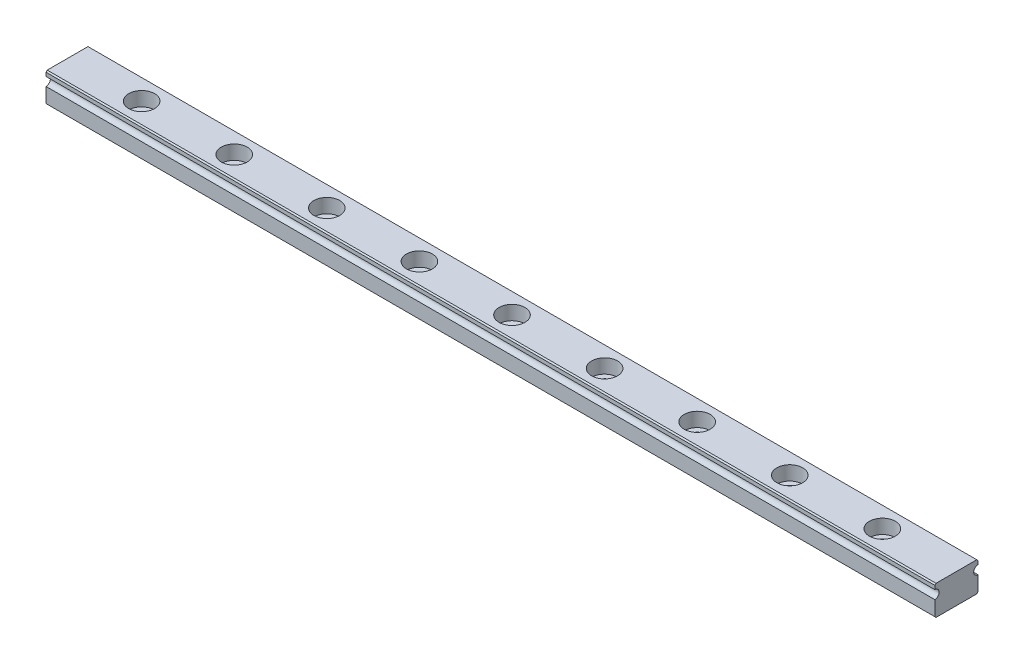
ISO-10303-21;
HEADER;
FILE_DESCRIPTION(('STEP AP214'),'2;1');
FILE_NAME('part.step','',(''),(''),'','','');
FILE_SCHEMA(('AUTOMOTIVE_DESIGN { 1 0 10303 214 1 1 1 1 }'));
ENDSEC;
DATA;
#1=APPLICATION_CONTEXT('core data for automotive mechanical design processes');
#2=APPLICATION_PROTOCOL_DEFINITION('international standard','automotive_design',2000,#1);
#3=PRODUCT_CONTEXT('',#1,'mechanical');
#4=PRODUCT('Part','Part','',(#3));
#5=PRODUCT_RELATED_PRODUCT_CATEGORY('part','',(#4));
#6=PRODUCT_DEFINITION_FORMATION('','',#4);
#7=PRODUCT_DEFINITION_CONTEXT('part definition',#1,'design');
#8=PRODUCT_DEFINITION('design','',#6,#7);
#9=PRODUCT_DEFINITION_SHAPE('','',#8);
#10=(LENGTH_UNIT() NAMED_UNIT(*) SI_UNIT(.MILLI.,.METRE.));
#11=(NAMED_UNIT(*) PLANE_ANGLE_UNIT() SI_UNIT($,.RADIAN.));
#12=(NAMED_UNIT(*) SI_UNIT($,.STERADIAN.) SOLID_ANGLE_UNIT());
#13=UNCERTAINTY_MEASURE_WITH_UNIT(LENGTH_MEASURE(1.E-05),#10,'distance_accuracy_value','');
#14=(GEOMETRIC_REPRESENTATION_CONTEXT(3) GLOBAL_UNCERTAINTY_ASSIGNED_CONTEXT((#13)) GLOBAL_UNIT_ASSIGNED_CONTEXT((#10,
#11,#12)) REPRESENTATION_CONTEXT('',''));
#15=CARTESIAN_POINT('',(0.,0.,0.));
#16=DIRECTION('',(0.,0.,1.));
#17=DIRECTION('',(1.,0.,0.));
#18=AXIS2_PLACEMENT_3D('',#15,#16,#17);
#19=CARTESIAN_POINT('',(144.,0.902010101267767,-3.49798989873223));
#20=DIRECTION('',(-1.,0.,0.));
#21=DIRECTION('',(0.,0.,1.));
#22=AXIS2_PLACEMENT_3D('',#19,#20,#21);
#23=CYLINDRICAL_SURFACE('',#22,0.7);
#24=CARTESIAN_POINT('',(0.,0.902010101267767,-3.49798989873223));
#25=DIRECTION('',(-1.,0.,0.));
#26=DIRECTION('',(0.,0.,-1.));
#27=AXIS2_PLACEMENT_3D('',#24,#25,#26);
#28=CIRCLE('',#27,0.7);
#29=CARTESIAN_POINT('',(0.,0.202010101267767,-3.49798989873223));
#30=VERTEX_POINT('',#29);
#31=CARTESIAN_POINT('',(0.,1.60201010126777,-3.49798989873223));
#32=VERTEX_POINT('',#31);
#33=EDGE_CURVE('E156',#30,#32,#28,.T.);
#34=ORIENTED_EDGE('',*,*,#33,.T.);
#35=DIRECTION('',(-1.,0.,0.));
#36=VECTOR('',#35,1.);
#37=CARTESIAN_POINT('',(144.,1.60201010126777,-3.49798989873223));
#38=LINE('',#37,#36);
#39=CARTESIAN_POINT('',(144.,1.60201010126777,-3.49798989873223));
#40=VERTEX_POINT('',#39);
#41=EDGE_CURVE('E11',#40,#32,#38,.T.);
#42=ORIENTED_EDGE('',*,*,#41,.F.);
#43=CARTESIAN_POINT('',(144.,0.902010101267767,-3.49798989873223));
#44=DIRECTION('',(-1.,0.,0.));
#45=DIRECTION('',(0.,0.,-1.));
#46=AXIS2_PLACEMENT_3D('',#43,#44,#45);
#47=CIRCLE('',#46,0.7);
#48=CARTESIAN_POINT('',(144.,0.202010101267767,-3.49798989873223));
#49=VERTEX_POINT('',#48);
#50=EDGE_CURVE('E179',#49,#40,#47,.T.);
#51=ORIENTED_EDGE('',*,*,#50,.F.);
#52=DIRECTION('',(-1.,0.,0.));
#53=VECTOR('',#52,1.);
#54=CARTESIAN_POINT('',(144.,0.202010101267767,-3.49798989873223));
#55=LINE('',#54,#53);
#56=EDGE_CURVE('E152',#49,#30,#55,.T.);
#57=ORIENTED_EDGE('',*,*,#56,.T.);
#58=EDGE_LOOP('',(#34,#42,#51,#57));
#59=FACE_BOUND('',#58,.T.);
#60=ADVANCED_FACE('F34',(#59),#23,.F.);
#61=CARTESIAN_POINT('',(144.,2.20201010126777,-3.49798989873223));
#62=DIRECTION('',(0.,0.,1.));
#63=DIRECTION('',(0.,-1.,0.));
#64=AXIS2_PLACEMENT_3D('',#61,#62,#63);
#65=PLANE('',#64);
#66=DIRECTION('',(0.,1.,0.));
#67=VECTOR('',#66,1.);
#68=CARTESIAN_POINT('',(0.,2.20201010126777,-3.49798989873223));
#69=LINE('',#68,#67);
#70=CARTESIAN_POINT('',(0.,2.20201010126777,-3.49798989873223));
#71=VERTEX_POINT('',#70);
#72=EDGE_CURVE('E159',#32,#71,#69,.T.);
#73=ORIENTED_EDGE('',*,*,#72,.T.);
#74=DIRECTION('',(-1.,0.,0.));
#75=VECTOR('',#74,1.);
#76=CARTESIAN_POINT('',(144.,2.20201010126777,-3.49798989873223));
#77=LINE('',#76,#75);
#78=CARTESIAN_POINT('',(144.,2.20201010126777,-3.49798989873223));
#79=VERTEX_POINT('',#78);
#80=EDGE_CURVE('E43',#79,#71,#77,.T.);
#81=ORIENTED_EDGE('',*,*,#80,.F.);
#82=DIRECTION('',(0.,1.,0.));
#83=VECTOR('',#82,1.);
#84=CARTESIAN_POINT('',(144.,2.20201010126777,-3.49798989873223));
#85=LINE('',#84,#83);
#86=EDGE_CURVE('E107',#40,#79,#85,.T.);
#87=ORIENTED_EDGE('',*,*,#86,.F.);
#88=ORIENTED_EDGE('',*,*,#41,.T.);
#89=EDGE_LOOP('',(#73,#81,#87,#88));
#90=FACE_BOUND('',#89,.T.);
#91=ADVANCED_FACE('F283',(#90),#65,.F.);
#92=CARTESIAN_POINT('',(144.,2.4,-3.3));
#93=DIRECTION('',(0.,-0.707106781186551,0.707106781186544));
#94=DIRECTION('',(0.,-0.707106781186544,-0.707106781186551));
#95=AXIS2_PLACEMENT_3D('',#92,#93,#94);
#96=PLANE('',#95);
#97=DIRECTION('',(0.,0.707106781186544,0.707106781186551));
#98=VECTOR('',#97,1.);
#99=CARTESIAN_POINT('',(0.,2.4,-3.3));
#100=LINE('',#99,#98);
#101=CARTESIAN_POINT('',(0.,2.4,-3.3));
#102=VERTEX_POINT('',#101);
#103=EDGE_CURVE('E162',#71,#102,#100,.T.);
#104=ORIENTED_EDGE('',*,*,#103,.T.);
#105=DIRECTION('',(-1.,0.,0.));
#106=VECTOR('',#105,1.);
#107=CARTESIAN_POINT('',(144.,2.4,-3.3));
#108=LINE('',#107,#106);
#109=CARTESIAN_POINT('',(144.,2.4,-3.3));
#110=VERTEX_POINT('',#109);
#111=EDGE_CURVE('E198',#110,#102,#108,.T.);
#112=ORIENTED_EDGE('',*,*,#111,.F.);
#113=DIRECTION('',(0.,0.707106781186544,0.707106781186551));
#114=VECTOR('',#113,1.);
#115=CARTESIAN_POINT('',(144.,2.4,-3.3));
#116=LINE('',#115,#114);
#117=EDGE_CURVE('E244',#79,#110,#116,.T.);
#118=ORIENTED_EDGE('',*,*,#117,.F.);
#119=ORIENTED_EDGE('',*,*,#80,.T.);
#120=EDGE_LOOP('',(#104,#112,#118,#119));
#121=FACE_BOUND('',#120,.T.);
#122=ADVANCED_FACE('F287',(#121),#96,.F.);
#123=CARTESIAN_POINT('',(144.,2.4,3.3));
#124=DIRECTION('',(0.,-1.,0.));
#125=DIRECTION('',(0.,0.,-1.));
#126=AXIS2_PLACEMENT_3D('',#123,#124,#125);
#127=PLANE('',#126);
#128=CARTESIAN_POINT('',(12.,2.4,0.));
#129=DIRECTION('',(0.,1.,0.));
#130=DIRECTION('',(0.,0.,1.));
#131=AXIS2_PLACEMENT_3D('',#128,#129,#130);
#132=CIRCLE('',#131,2.1);
#133=CARTESIAN_POINT('',(12.,2.4,2.1));
#134=VERTEX_POINT('',#133);
#135=EDGE_CURVE('E359',#134,#134,#132,.T.);
#136=ORIENTED_EDGE('',*,*,#135,.F.);
#137=EDGE_LOOP('',(#136));
#138=FACE_BOUND('',#137,.T.);
#139=CARTESIAN_POINT('',(27.,2.4,0.));
#140=DIRECTION('',(0.,1.,0.));
#141=DIRECTION('',(0.,0.,1.));
#142=AXIS2_PLACEMENT_3D('',#139,#140,#141);
#143=CIRCLE('',#142,2.1);
#144=CARTESIAN_POINT('',(27.,2.4,2.1));
#145=VERTEX_POINT('',#144);
#146=EDGE_CURVE('E365',#145,#145,#143,.T.);
#147=ORIENTED_EDGE('',*,*,#146,.F.);
#148=EDGE_LOOP('',(#147));
#149=FACE_BOUND('',#148,.T.);
#150=CARTESIAN_POINT('',(42.,2.4,0.));
#151=DIRECTION('',(0.,1.,0.));
#152=DIRECTION('',(0.,0.,1.));
#153=AXIS2_PLACEMENT_3D('',#150,#151,#152);
#154=CIRCLE('',#153,2.1);
#155=CARTESIAN_POINT('',(42.,2.4,2.1));
#156=VERTEX_POINT('',#155);
#157=EDGE_CURVE('E371',#156,#156,#154,.T.);
#158=ORIENTED_EDGE('',*,*,#157,.F.);
#159=EDGE_LOOP('',(#158));
#160=FACE_BOUND('',#159,.T.);
#161=CARTESIAN_POINT('',(57.,2.4,0.));
#162=DIRECTION('',(0.,1.,0.));
#163=DIRECTION('',(0.,0.,1.));
#164=AXIS2_PLACEMENT_3D('',#161,#162,#163);
#165=CIRCLE('',#164,2.1);
#166=CARTESIAN_POINT('',(57.,2.4,2.1));
#167=VERTEX_POINT('',#166);
#168=EDGE_CURVE('E377',#167,#167,#165,.T.);
#169=ORIENTED_EDGE('',*,*,#168,.F.);
#170=EDGE_LOOP('',(#169));
#171=FACE_BOUND('',#170,.T.);
#172=CARTESIAN_POINT('',(72.,2.4,0.));
#173=DIRECTION('',(0.,1.,0.));
#174=DIRECTION('',(0.,0.,1.));
#175=AXIS2_PLACEMENT_3D('',#172,#173,#174);
#176=CIRCLE('',#175,2.09999999999999);
#177=CARTESIAN_POINT('',(72.,2.4,2.09999999999999));
#178=VERTEX_POINT('',#177);
#179=EDGE_CURVE('E383',#178,#178,#176,.T.);
#180=ORIENTED_EDGE('',*,*,#179,.F.);
#181=EDGE_LOOP('',(#180));
#182=FACE_BOUND('',#181,.T.);
#183=CARTESIAN_POINT('',(87.,2.4,0.));
#184=DIRECTION('',(0.,1.,0.));
#185=DIRECTION('',(0.,0.,1.));
#186=AXIS2_PLACEMENT_3D('',#183,#184,#185);
#187=CIRCLE('',#186,2.09999999999999);
#188=CARTESIAN_POINT('',(87.,2.4,2.09999999999999));
#189=VERTEX_POINT('',#188);
#190=EDGE_CURVE('E389',#189,#189,#187,.T.);
#191=ORIENTED_EDGE('',*,*,#190,.F.);
#192=EDGE_LOOP('',(#191));
#193=FACE_BOUND('',#192,.T.);
#194=CARTESIAN_POINT('',(102.,2.4,0.));
#195=DIRECTION('',(0.,1.,0.));
#196=DIRECTION('',(0.,0.,1.));
#197=AXIS2_PLACEMENT_3D('',#194,#195,#196);
#198=CIRCLE('',#197,2.09999999999999);
#199=CARTESIAN_POINT('',(102.,2.4,2.09999999999999));
#200=VERTEX_POINT('',#199);
#201=EDGE_CURVE('E395',#200,#200,#198,.T.);
#202=ORIENTED_EDGE('',*,*,#201,.F.);
#203=EDGE_LOOP('',(#202));
#204=FACE_BOUND('',#203,.T.);
#205=CARTESIAN_POINT('',(117.,2.4,0.));
#206=DIRECTION('',(0.,1.,0.));
#207=DIRECTION('',(0.,0.,1.));
#208=AXIS2_PLACEMENT_3D('',#205,#206,#207);
#209=CIRCLE('',#208,2.09999999999999);
#210=CARTESIAN_POINT('',(117.,2.4,2.09999999999999));
#211=VERTEX_POINT('',#210);
#212=EDGE_CURVE('E238',#211,#211,#209,.T.);
#213=ORIENTED_EDGE('',*,*,#212,.F.);
#214=EDGE_LOOP('',(#213));
#215=FACE_BOUND('',#214,.T.);
#216=CARTESIAN_POINT('',(132.,2.4,0.));
#217=DIRECTION('',(0.,1.,0.));
#218=DIRECTION('',(0.,0.,1.));
#219=AXIS2_PLACEMENT_3D('',#216,#217,#218);
#220=CIRCLE('',#219,2.09999999999999);
#221=CARTESIAN_POINT('',(132.,2.4,2.09999999999999));
#222=VERTEX_POINT('',#221);
#223=EDGE_CURVE('E229',#222,#222,#220,.T.);
#224=ORIENTED_EDGE('',*,*,#223,.F.);
#225=EDGE_LOOP('',(#224));
#226=FACE_BOUND('',#225,.T.);
#227=DIRECTION('',(0.,0.,1.));
#228=VECTOR('',#227,1.);
#229=CARTESIAN_POINT('',(0.,2.4,3.3));
#230=LINE('',#229,#228);
#231=CARTESIAN_POINT('',(0.,2.4,3.3));
#232=VERTEX_POINT('',#231);
#233=EDGE_CURVE('E164',#102,#232,#230,.T.);
#234=ORIENTED_EDGE('',*,*,#233,.T.);
#235=DIRECTION('',(-1.,0.,0.));
#236=VECTOR('',#235,1.);
#237=CARTESIAN_POINT('',(144.,2.4,3.3));
#238=LINE('',#237,#236);
#239=CARTESIAN_POINT('',(144.,2.4,3.3));
#240=VERTEX_POINT('',#239);
#241=EDGE_CURVE('E195',#240,#232,#238,.T.);
#242=ORIENTED_EDGE('',*,*,#241,.F.);
#243=DIRECTION('',(0.,0.,1.));
#244=VECTOR('',#243,1.);
#245=CARTESIAN_POINT('',(144.,2.4,3.3));
#246=LINE('',#245,#244);
#247=EDGE_CURVE('E246',#110,#240,#246,.T.);
#248=ORIENTED_EDGE('',*,*,#247,.F.);
#249=ORIENTED_EDGE('',*,*,#111,.T.);
#250=EDGE_LOOP('',(#234,#242,#248,#249));
#251=FACE_BOUND('',#250,.T.);
#252=ADVANCED_FACE('F291',(#138,#149,#160,#171,#182,#193,#204,#215,#226,#251),#127,.F.);
#253=CARTESIAN_POINT('',(144.,2.4,3.3));
#254=DIRECTION('',(0.,-0.70710678118655,-0.707106781186545));
#255=DIRECTION('',(0.,0.707106781186545,-0.70710678118655));
#256=AXIS2_PLACEMENT_3D('',#253,#254,#255);
#257=PLANE('',#256);
#258=DIRECTION('',(0.,-0.707106781186545,0.70710678118655));
#259=VECTOR('',#258,1.);
#260=CARTESIAN_POINT('',(0.,2.4,3.3));
#261=LINE('',#260,#259);
#262=CARTESIAN_POINT('',(0.,2.20201010126777,3.49798989873223));
#263=VERTEX_POINT('',#262);
#264=EDGE_CURVE('E166',#232,#263,#261,.T.);
#265=ORIENTED_EDGE('',*,*,#264,.T.);
#266=DIRECTION('',(-1.,0.,0.));
#267=VECTOR('',#266,1.);
#268=CARTESIAN_POINT('',(144.,2.20201010126777,3.49798989873223));
#269=LINE('',#268,#267);
#270=CARTESIAN_POINT('',(144.,2.20201010126777,3.49798989873223));
#271=VERTEX_POINT('',#270);
#272=EDGE_CURVE('E192',#271,#263,#269,.T.);
#273=ORIENTED_EDGE('',*,*,#272,.F.);
#274=DIRECTION('',(0.,-0.707106781186545,0.70710678118655));
#275=VECTOR('',#274,1.);
#276=CARTESIAN_POINT('',(144.,2.4,3.3));
#277=LINE('',#276,#275);
#278=EDGE_CURVE('E248',#240,#271,#277,.T.);
#279=ORIENTED_EDGE('',*,*,#278,.F.);
#280=ORIENTED_EDGE('',*,*,#241,.T.);
#281=EDGE_LOOP('',(#265,#273,#279,#280));
#282=FACE_BOUND('',#281,.T.);
#283=ADVANCED_FACE('F297',(#282),#257,.F.);
#284=CARTESIAN_POINT('',(144.,2.20201010126777,3.49798989873223));
#285=DIRECTION('',(0.,0.,-1.));
#286=DIRECTION('',(0.,1.,0.));
#287=AXIS2_PLACEMENT_3D('',#284,#285,#286);
#288=PLANE('',#287);
#289=DIRECTION('',(0.,-1.,0.));
#290=VECTOR('',#289,1.);
#291=CARTESIAN_POINT('',(0.,2.20201010126777,3.49798989873223));
#292=LINE('',#291,#290);
#293=CARTESIAN_POINT('',(0.,1.60201010126777,3.49798989873223));
#294=VERTEX_POINT('',#293);
#295=EDGE_CURVE('E168',#263,#294,#292,.T.);
#296=ORIENTED_EDGE('',*,*,#295,.T.);
#297=DIRECTION('',(-1.,0.,0.));
#298=VECTOR('',#297,1.);
#299=CARTESIAN_POINT('',(144.,1.60201010126777,3.49798989873223));
#300=LINE('',#299,#298);
#301=CARTESIAN_POINT('',(144.,1.60201010126777,3.49798989873223));
#302=VERTEX_POINT('',#301);
#303=EDGE_CURVE('E189',#302,#294,#300,.T.);
#304=ORIENTED_EDGE('',*,*,#303,.F.);
#305=DIRECTION('',(0.,-1.,0.));
#306=VECTOR('',#305,1.);
#307=CARTESIAN_POINT('',(144.,2.20201010126777,3.49798989873223));
#308=LINE('',#307,#306);
#309=EDGE_CURVE('E250',#271,#302,#308,.T.);
#310=ORIENTED_EDGE('',*,*,#309,.F.);
#311=ORIENTED_EDGE('',*,*,#272,.T.);
#312=EDGE_LOOP('',(#296,#304,#310,#311));
#313=FACE_BOUND('',#312,.T.);
#314=ADVANCED_FACE('F301',(#313),#288,.F.);
#315=CARTESIAN_POINT('',(144.,0.902010101267767,3.49798989873223));
#316=DIRECTION('',(-1.,0.,0.));
#317=DIRECTION('',(0.,0.,1.));
#318=AXIS2_PLACEMENT_3D('',#315,#316,#317);
#319=CYLINDRICAL_SURFACE('',#318,0.7);
#320=CARTESIAN_POINT('',(0.,0.902010101267767,3.49798989873223));
#321=DIRECTION('',(-1.,0.,0.));
#322=DIRECTION('',(0.,0.,1.));
#323=AXIS2_PLACEMENT_3D('',#320,#321,#322);
#324=CIRCLE('',#323,0.7);
#325=CARTESIAN_POINT('',(0.,0.202010101267767,3.49798989873223));
#326=VERTEX_POINT('',#325);
#327=EDGE_CURVE('E170',#294,#326,#324,.T.);
#328=ORIENTED_EDGE('',*,*,#327,.T.);
#329=DIRECTION('',(-1.,0.,0.));
#330=VECTOR('',#329,1.);
#331=CARTESIAN_POINT('',(144.,0.202010101267767,3.49798989873223));
#332=LINE('',#331,#330);
#333=CARTESIAN_POINT('',(144.,0.202010101267767,3.49798989873223));
#334=VERTEX_POINT('',#333);
#335=EDGE_CURVE('E186',#334,#326,#332,.T.);
#336=ORIENTED_EDGE('',*,*,#335,.F.);
#337=CARTESIAN_POINT('',(144.,0.902010101267767,3.49798989873223));
#338=DIRECTION('',(-1.,0.,0.));
#339=DIRECTION('',(0.,0.,1.));
#340=AXIS2_PLACEMENT_3D('',#337,#338,#339);
#341=CIRCLE('',#340,0.7);
#342=EDGE_CURVE('E252',#302,#334,#341,.T.);
#343=ORIENTED_EDGE('',*,*,#342,.F.);
#344=ORIENTED_EDGE('',*,*,#303,.T.);
#345=EDGE_LOOP('',(#328,#336,#343,#344));
#346=FACE_BOUND('',#345,.T.);
#347=ADVANCED_FACE('F305',(#346),#319,.F.);
#348=CARTESIAN_POINT('',(144.,0.202010101267767,3.49798989873223));
#349=DIRECTION('',(0.,0.,-1.));
#350=DIRECTION('',(0.,1.,0.));
#351=AXIS2_PLACEMENT_3D('',#348,#349,#350);
#352=PLANE('',#351);
#353=DIRECTION('',(0.,-1.,0.));
#354=VECTOR('',#353,1.);
#355=CARTESIAN_POINT('',(0.,0.202010101267767,3.49798989873223));
#356=LINE('',#355,#354);
#357=CARTESIAN_POINT('',(0.,-2.19798989873223,3.49798989873223));
#358=VERTEX_POINT('',#357);
#359=EDGE_CURVE('E172',#326,#358,#356,.T.);
#360=ORIENTED_EDGE('',*,*,#359,.T.);
#361=DIRECTION('',(-1.,0.,0.));
#362=VECTOR('',#361,1.);
#363=CARTESIAN_POINT('',(144.,-2.19798989873223,3.49798989873223));
#364=LINE('',#363,#362);
#365=CARTESIAN_POINT('',(144.,-2.19798989873223,3.49798989873223));
#366=VERTEX_POINT('',#365);
#367=EDGE_CURVE('E183',#366,#358,#364,.T.);
#368=ORIENTED_EDGE('',*,*,#367,.F.);
#369=DIRECTION('',(0.,-1.,0.));
#370=VECTOR('',#369,1.);
#371=CARTESIAN_POINT('',(144.,0.202010101267767,3.49798989873223));
#372=LINE('',#371,#370);
#373=EDGE_CURVE('E254',#334,#366,#372,.T.);
#374=ORIENTED_EDGE('',*,*,#373,.F.);
#375=ORIENTED_EDGE('',*,*,#335,.T.);
#376=EDGE_LOOP('',(#360,#368,#374,#375));
#377=FACE_BOUND('',#376,.T.);
#378=ADVANCED_FACE('F260',(#377),#352,.F.);
#379=CARTESIAN_POINT('',(144.,-2.19798989873223,3.49798989873223));
#380=DIRECTION('',(0.,0.707106781186547,-0.707106781186548));
#381=DIRECTION('',(0.,0.707106781186548,0.707106781186547));
#382=AXIS2_PLACEMENT_3D('',#379,#380,#381);
#383=PLANE('',#382);
#384=DIRECTION('',(0.,-0.707106781186548,-0.707106781186547));
#385=VECTOR('',#384,1.);
#386=CARTESIAN_POINT('',(0.,-2.19798989873223,3.49798989873223));
#387=LINE('',#386,#385);
#388=CARTESIAN_POINT('',(0.,-2.39597979746447,3.3));
#389=VERTEX_POINT('',#388);
#390=EDGE_CURVE('E174',#358,#389,#387,.T.);
#391=ORIENTED_EDGE('',*,*,#390,.T.);
#392=DIRECTION('',(-1.,0.,0.));
#393=VECTOR('',#392,1.);
#394=CARTESIAN_POINT('',(144.,-2.39597979746447,3.3));
#395=LINE('',#394,#393);
#396=CARTESIAN_POINT('',(144.,-2.39597979746447,3.3));
#397=VERTEX_POINT('',#396);
#398=EDGE_CURVE('E147',#397,#389,#395,.T.);
#399=ORIENTED_EDGE('',*,*,#398,.F.);
#400=DIRECTION('',(0.,-0.707106781186548,-0.707106781186547));
#401=VECTOR('',#400,1.);
#402=CARTESIAN_POINT('',(144.,-2.19798989873223,3.49798989873223));
#403=LINE('',#402,#401);
#404=EDGE_CURVE('E138',#366,#397,#403,.T.);
#405=ORIENTED_EDGE('',*,*,#404,.F.);
#406=ORIENTED_EDGE('',*,*,#367,.T.);
#407=EDGE_LOOP('',(#391,#399,#405,#406));
#408=FACE_BOUND('',#407,.T.);
#409=ADVANCED_FACE('F264',(#408),#383,.F.);
#410=CARTESIAN_POINT('',(144.,-2.39597979746447,-3.3));
#411=DIRECTION('',(0.,1.,0.));
#412=DIRECTION('',(0.,0.,1.));
#413=AXIS2_PLACEMENT_3D('',#410,#411,#412);
#414=PLANE('',#413);
#415=CARTESIAN_POINT('',(12.,-2.39597979746447,0.));
#416=DIRECTION('',(0.,1.,0.));
#417=DIRECTION('',(0.,0.,1.));
#418=AXIS2_PLACEMENT_3D('',#415,#416,#417);
#419=CIRCLE('',#418,1.2);
#420=CARTESIAN_POINT('',(12.,-2.39597979746447,1.2));
#421=VERTEX_POINT('',#420);
#422=EDGE_CURVE('E207',#421,#421,#419,.T.);
#423=ORIENTED_EDGE('',*,*,#422,.T.);
#424=EDGE_LOOP('',(#423));
#425=FACE_BOUND('',#424,.T.);
#426=CARTESIAN_POINT('',(27.,-2.39597979746447,0.));
#427=DIRECTION('',(0.,1.,0.));
#428=DIRECTION('',(0.,0.,1.));
#429=AXIS2_PLACEMENT_3D('',#426,#427,#428);
#430=CIRCLE('',#429,1.2);
#431=CARTESIAN_POINT('',(27.,-2.39597979746447,1.2));
#432=VERTEX_POINT('',#431);
#433=EDGE_CURVE('E324',#432,#432,#430,.T.);
#434=ORIENTED_EDGE('',*,*,#433,.T.);
#435=EDGE_LOOP('',(#434));
#436=FACE_BOUND('',#435,.T.);
#437=CARTESIAN_POINT('',(42.,-2.39597979746447,0.));
#438=DIRECTION('',(0.,1.,0.));
#439=DIRECTION('',(0.,0.,1.));
#440=AXIS2_PLACEMENT_3D('',#437,#438,#439);
#441=CIRCLE('',#440,1.2);
#442=CARTESIAN_POINT('',(42.,-2.39597979746447,1.2));
#443=VERTEX_POINT('',#442);
#444=EDGE_CURVE('E328',#443,#443,#441,.T.);
#445=ORIENTED_EDGE('',*,*,#444,.T.);
#446=EDGE_LOOP('',(#445));
#447=FACE_BOUND('',#446,.T.);
#448=CARTESIAN_POINT('',(57.,-2.39597979746447,0.));
#449=DIRECTION('',(0.,1.,0.));
#450=DIRECTION('',(0.,0.,1.));
#451=AXIS2_PLACEMENT_3D('',#448,#449,#450);
#452=CIRCLE('',#451,1.2);
#453=CARTESIAN_POINT('',(57.,-2.39597979746447,1.2));
#454=VERTEX_POINT('',#453);
#455=EDGE_CURVE('E332',#454,#454,#452,.T.);
#456=ORIENTED_EDGE('',*,*,#455,.T.);
#457=EDGE_LOOP('',(#456));
#458=FACE_BOUND('',#457,.T.);
#459=CARTESIAN_POINT('',(72.,-2.39597979746447,0.));
#460=DIRECTION('',(0.,1.,0.));
#461=DIRECTION('',(0.,0.,1.));
#462=AXIS2_PLACEMENT_3D('',#459,#460,#461);
#463=CIRCLE('',#462,1.2);
#464=CARTESIAN_POINT('',(72.,-2.39597979746447,1.2));
#465=VERTEX_POINT('',#464);
#466=EDGE_CURVE('E336',#465,#465,#463,.T.);
#467=ORIENTED_EDGE('',*,*,#466,.T.);
#468=EDGE_LOOP('',(#467));
#469=FACE_BOUND('',#468,.T.);
#470=CARTESIAN_POINT('',(87.,-2.39597979746447,0.));
#471=DIRECTION('',(0.,1.,0.));
#472=DIRECTION('',(0.,0.,1.));
#473=AXIS2_PLACEMENT_3D('',#470,#471,#472);
#474=CIRCLE('',#473,1.2);
#475=CARTESIAN_POINT('',(87.,-2.39597979746447,1.2));
#476=VERTEX_POINT('',#475);
#477=EDGE_CURVE('E340',#476,#476,#474,.T.);
#478=ORIENTED_EDGE('',*,*,#477,.T.);
#479=EDGE_LOOP('',(#478));
#480=FACE_BOUND('',#479,.T.);
#481=CARTESIAN_POINT('',(102.,-2.39597979746447,0.));
#482=DIRECTION('',(0.,1.,0.));
#483=DIRECTION('',(0.,0.,1.));
#484=AXIS2_PLACEMENT_3D('',#481,#482,#483);
#485=CIRCLE('',#484,1.2);
#486=CARTESIAN_POINT('',(102.,-2.39597979746447,1.2));
#487=VERTEX_POINT('',#486);
#488=EDGE_CURVE('E344',#487,#487,#485,.T.);
#489=ORIENTED_EDGE('',*,*,#488,.T.);
#490=EDGE_LOOP('',(#489));
#491=FACE_BOUND('',#490,.T.);
#492=CARTESIAN_POINT('',(117.,-2.39597979746447,0.));
#493=DIRECTION('',(0.,1.,0.));
#494=DIRECTION('',(0.,0.,1.));
#495=AXIS2_PLACEMENT_3D('',#492,#493,#494);
#496=CIRCLE('',#495,1.2);
#497=CARTESIAN_POINT('',(117.,-2.39597979746447,1.2));
#498=VERTEX_POINT('',#497);
#499=EDGE_CURVE('E348',#498,#498,#496,.T.);
#500=ORIENTED_EDGE('',*,*,#499,.T.);
#501=EDGE_LOOP('',(#500));
#502=FACE_BOUND('',#501,.T.);
#503=CARTESIAN_POINT('',(132.,-2.39597979746447,0.));
#504=DIRECTION('',(0.,1.,0.));
#505=DIRECTION('',(0.,0.,1.));
#506=AXIS2_PLACEMENT_3D('',#503,#504,#505);
#507=CIRCLE('',#506,1.19999999999999);
#508=CARTESIAN_POINT('',(132.,-2.39597979746447,1.19999999999998));
#509=VERTEX_POINT('',#508);
#510=EDGE_CURVE('E351',#509,#509,#507,.T.);
#511=ORIENTED_EDGE('',*,*,#510,.T.);
#512=EDGE_LOOP('',(#511));
#513=FACE_BOUND('',#512,.T.);
#514=DIRECTION('',(0.,0.,-1.));
#515=VECTOR('',#514,1.);
#516=CARTESIAN_POINT('',(0.,-2.39597979746447,-3.3));
#517=LINE('',#516,#515);
#518=CARTESIAN_POINT('',(0.,-2.39597979746447,-3.3));
#519=VERTEX_POINT('',#518);
#520=EDGE_CURVE('E146',#389,#519,#517,.T.);
#521=ORIENTED_EDGE('',*,*,#520,.T.);
#522=DIRECTION('',(-1.,0.,0.));
#523=VECTOR('',#522,1.);
#524=CARTESIAN_POINT('',(144.,-2.39597979746447,-3.3));
#525=LINE('',#524,#523);
#526=CARTESIAN_POINT('',(144.,-2.39597979746447,-3.3));
#527=VERTEX_POINT('',#526);
#528=EDGE_CURVE('E143',#527,#519,#525,.T.);
#529=ORIENTED_EDGE('',*,*,#528,.F.);
#530=DIRECTION('',(0.,0.,-1.));
#531=VECTOR('',#530,1.);
#532=CARTESIAN_POINT('',(144.,-2.39597979746447,-3.3));
#533=LINE('',#532,#531);
#534=EDGE_CURVE('E132',#397,#527,#533,.T.);
#535=ORIENTED_EDGE('',*,*,#534,.F.);
#536=ORIENTED_EDGE('',*,*,#398,.T.);
#537=EDGE_LOOP('',(#521,#529,#535,#536));
#538=FACE_BOUND('',#537,.T.);
#539=ADVANCED_FACE('F144',(#425,#436,#447,#458,#469,#480,#491,#502,#513,#538),#414,.F.);
#540=CARTESIAN_POINT('',(144.,-2.19798989873223,-3.49798989873223));
#541=DIRECTION('',(0.,0.707106781186547,0.707106781186548));
#542=DIRECTION('',(0.,-0.707106781186548,0.707106781186547));
#543=AXIS2_PLACEMENT_3D('',#540,#541,#542);
#544=PLANE('',#543);
#545=DIRECTION('',(0.,0.707106781186548,-0.707106781186547));
#546=VECTOR('',#545,1.);
#547=CARTESIAN_POINT('',(0.,-2.19798989873223,-3.49798989873223));
#548=LINE('',#547,#546);
#549=CARTESIAN_POINT('',(0.,-2.19798989873223,-3.49798989873223));
#550=VERTEX_POINT('',#549);
#551=EDGE_CURVE('E93',#519,#550,#548,.T.);
#552=ORIENTED_EDGE('',*,*,#551,.T.);
#553=DIRECTION('',(-1.,0.,0.));
#554=VECTOR('',#553,1.);
#555=CARTESIAN_POINT('',(144.,-2.19798989873223,-3.49798989873223));
#556=LINE('',#555,#554);
#557=CARTESIAN_POINT('',(144.,-2.19798989873223,-3.49798989873223));
#558=VERTEX_POINT('',#557);
#559=EDGE_CURVE('E148',#558,#550,#556,.T.);
#560=ORIENTED_EDGE('',*,*,#559,.F.);
#561=DIRECTION('',(0.,0.707106781186548,-0.707106781186547));
#562=VECTOR('',#561,1.);
#563=CARTESIAN_POINT('',(144.,-2.19798989873223,-3.49798989873223));
#564=LINE('',#563,#562);
#565=EDGE_CURVE('E136',#527,#558,#564,.T.);
#566=ORIENTED_EDGE('',*,*,#565,.F.);
#567=ORIENTED_EDGE('',*,*,#528,.T.);
#568=EDGE_LOOP('',(#552,#560,#566,#567));
#569=FACE_BOUND('',#568,.T.);
#570=ADVANCED_FACE('F150',(#569),#544,.F.);
#571=CARTESIAN_POINT('',(144.,0.202010101267767,-3.49798989873223));
#572=DIRECTION('',(0.,0.,1.));
#573=DIRECTION('',(0.,-1.,0.));
#574=AXIS2_PLACEMENT_3D('',#571,#572,#573);
#575=PLANE('',#574);
#576=DIRECTION('',(0.,1.,0.));
#577=VECTOR('',#576,1.);
#578=CARTESIAN_POINT('',(0.,0.202010101267767,-3.49798989873223));
#579=LINE('',#578,#577);
#580=EDGE_CURVE('E99',#550,#30,#579,.T.);
#581=ORIENTED_EDGE('',*,*,#580,.T.);
#582=ORIENTED_EDGE('',*,*,#56,.F.);
#583=DIRECTION('',(0.,1.,0.));
#584=VECTOR('',#583,1.);
#585=CARTESIAN_POINT('',(144.,0.202010101267767,-3.49798989873223));
#586=LINE('',#585,#584);
#587=EDGE_CURVE('E52',#558,#49,#586,.T.);
#588=ORIENTED_EDGE('',*,*,#587,.F.);
#589=ORIENTED_EDGE('',*,*,#559,.T.);
#590=EDGE_LOOP('',(#581,#582,#588,#589));
#591=FACE_BOUND('',#590,.T.);
#592=ADVANCED_FACE('F272',(#591),#575,.F.);
#593=CARTESIAN_POINT('',(144.,0.902010101267767,-3.49798989873223));
#594=DIRECTION('',(1.,0.,0.));
#595=DIRECTION('',(0.,0.,-1.));
#596=AXIS2_PLACEMENT_3D('',#593,#594,#595);
#597=PLANE('',#596);
#598=ORIENTED_EDGE('',*,*,#50,.T.);
#599=ORIENTED_EDGE('',*,*,#86,.T.);
#600=ORIENTED_EDGE('',*,*,#117,.T.);
#601=ORIENTED_EDGE('',*,*,#247,.T.);
#602=ORIENTED_EDGE('',*,*,#278,.T.);
#603=ORIENTED_EDGE('',*,*,#309,.T.);
#604=ORIENTED_EDGE('',*,*,#342,.T.);
#605=ORIENTED_EDGE('',*,*,#373,.T.);
#606=ORIENTED_EDGE('',*,*,#404,.T.);
#607=ORIENTED_EDGE('',*,*,#534,.T.);
#608=ORIENTED_EDGE('',*,*,#565,.T.);
#609=ORIENTED_EDGE('',*,*,#587,.T.);
#610=EDGE_LOOP('',(#598,#599,#600,#601,#602,#603,#604,#605,#606,#607,#608,#609));
#611=FACE_BOUND('',#610,.T.);
#612=ADVANCED_FACE('F134',(#611),#597,.T.);
#613=CARTESIAN_POINT('',(0.,0.902010101267767,-3.49798989873223));
#614=DIRECTION('',(1.,0.,0.));
#615=DIRECTION('',(0.,0.,-1.));
#616=AXIS2_PLACEMENT_3D('',#613,#614,#615);
#617=PLANE('',#616);
#618=ORIENTED_EDGE('',*,*,#33,.F.);
#619=ORIENTED_EDGE('',*,*,#580,.F.);
#620=ORIENTED_EDGE('',*,*,#551,.F.);
#621=ORIENTED_EDGE('',*,*,#520,.F.);
#622=ORIENTED_EDGE('',*,*,#390,.F.);
#623=ORIENTED_EDGE('',*,*,#359,.F.);
#624=ORIENTED_EDGE('',*,*,#327,.F.);
#625=ORIENTED_EDGE('',*,*,#295,.F.);
#626=ORIENTED_EDGE('',*,*,#264,.F.);
#627=ORIENTED_EDGE('',*,*,#233,.F.);
#628=ORIENTED_EDGE('',*,*,#103,.F.);
#629=ORIENTED_EDGE('',*,*,#72,.F.);
#630=EDGE_LOOP('',(#618,#619,#620,#621,#622,#623,#624,#625,#626,#627,#628,#629));
#631=FACE_BOUND('',#630,.T.);
#632=ADVANCED_FACE('F267',(#631),#617,.F.);
#633=CARTESIAN_POINT('',(132.,0.1,0.));
#634=DIRECTION('',(0.,1.,0.));
#635=DIRECTION('',(0.,0.,1.));
#636=AXIS2_PLACEMENT_3D('',#633,#634,#635);
#637=CYLINDRICAL_SURFACE('',#636,2.09999999999999);
#638=CARTESIAN_POINT('',(132.,0.1,0.));
#639=DIRECTION('',(0.,1.,0.));
#640=DIRECTION('',(0.,0.,1.));
#641=AXIS2_PLACEMENT_3D('',#638,#639,#640);
#642=CIRCLE('',#641,2.09999999999999);
#643=CARTESIAN_POINT('',(132.,0.1,2.09999999999999));
#644=VERTEX_POINT('',#643);
#645=EDGE_CURVE('E233',#644,#644,#642,.T.);
#646=ORIENTED_EDGE('',*,*,#645,.F.);
#647=EDGE_LOOP('',(#646));
#648=FACE_BOUND('',#647,.T.);
#649=ORIENTED_EDGE('',*,*,#223,.T.);
#650=EDGE_LOOP('',(#649));
#651=FACE_BOUND('',#650,.T.);
#652=ADVANCED_FACE('F431',(#648,#651),#637,.F.);
#653=CARTESIAN_POINT('',(132.,0.1,0.));
#654=DIRECTION('',(0.,1.,0.));
#655=DIRECTION('',(0.,0.,1.));
#656=AXIS2_PLACEMENT_3D('',#653,#654,#655);
#657=PLANE('',#656);
#658=CARTESIAN_POINT('',(132.,0.1,0.));
#659=DIRECTION('',(0.,1.,0.));
#660=DIRECTION('',(0.,0.,1.));
#661=AXIS2_PLACEMENT_3D('',#658,#659,#660);
#662=CIRCLE('',#661,1.19999999999999);
#663=CARTESIAN_POINT('',(132.,0.1,1.19999999999998));
#664=VERTEX_POINT('',#663);
#665=EDGE_CURVE('E37',#664,#664,#662,.T.);
#666=ORIENTED_EDGE('',*,*,#665,.F.);
#667=EDGE_LOOP('',(#666));
#668=FACE_BOUND('',#667,.T.);
#669=ORIENTED_EDGE('',*,*,#645,.T.);
#670=EDGE_LOOP('',(#669));
#671=FACE_BOUND('',#670,.T.);
#672=ADVANCED_FACE('F421',(#668,#671),#657,.T.);
#673=CARTESIAN_POINT('',(117.,0.1,0.));
#674=DIRECTION('',(0.,1.,0.));
#675=DIRECTION('',(0.,0.,1.));
#676=AXIS2_PLACEMENT_3D('',#673,#674,#675);
#677=CYLINDRICAL_SURFACE('',#676,2.09999999999999);
#678=CARTESIAN_POINT('',(117.,0.1,0.));
#679=DIRECTION('',(0.,1.,0.));
#680=DIRECTION('',(0.,0.,1.));
#681=AXIS2_PLACEMENT_3D('',#678,#679,#680);
#682=CIRCLE('',#681,2.09999999999999);
#683=CARTESIAN_POINT('',(117.,0.1,2.09999999999999));
#684=VERTEX_POINT('',#683);
#685=EDGE_CURVE('E398',#684,#684,#682,.T.);
#686=ORIENTED_EDGE('',*,*,#685,.F.);
#687=EDGE_LOOP('',(#686));
#688=FACE_BOUND('',#687,.T.);
#689=ORIENTED_EDGE('',*,*,#212,.T.);
#690=EDGE_LOOP('',(#689));
#691=FACE_BOUND('',#690,.T.);
#692=ADVANCED_FACE('F403',(#688,#691),#677,.F.);
#693=CARTESIAN_POINT('',(117.,0.1,0.));
#694=DIRECTION('',(0.,1.,0.));
#695=DIRECTION('',(0.,0.,1.));
#696=AXIS2_PLACEMENT_3D('',#693,#694,#695);
#697=PLANE('',#696);
#698=CARTESIAN_POINT('',(117.,0.1,0.));
#699=DIRECTION('',(0.,1.,0.));
#700=DIRECTION('',(0.,0.,1.));
#701=AXIS2_PLACEMENT_3D('',#698,#699,#700);
#702=CIRCLE('',#701,1.2);
#703=CARTESIAN_POINT('',(117.,0.1,1.2));
#704=VERTEX_POINT('',#703);
#705=EDGE_CURVE('E224',#704,#704,#702,.T.);
#706=ORIENTED_EDGE('',*,*,#705,.F.);
#707=EDGE_LOOP('',(#706));
#708=FACE_BOUND('',#707,.T.);
#709=ORIENTED_EDGE('',*,*,#685,.T.);
#710=EDGE_LOOP('',(#709));
#711=FACE_BOUND('',#710,.T.);
#712=ADVANCED_FACE('F420',(#708,#711),#697,.T.);
#713=CARTESIAN_POINT('',(102.,0.1,0.));
#714=DIRECTION('',(0.,1.,0.));
#715=DIRECTION('',(0.,0.,1.));
#716=AXIS2_PLACEMENT_3D('',#713,#714,#715);
#717=CYLINDRICAL_SURFACE('',#716,2.09999999999999);
#718=CARTESIAN_POINT('',(102.,0.1,0.));
#719=DIRECTION('',(0.,1.,0.));
#720=DIRECTION('',(0.,0.,1.));
#721=AXIS2_PLACEMENT_3D('',#718,#719,#720);
#722=CIRCLE('',#721,2.09999999999999);
#723=CARTESIAN_POINT('',(102.,0.1,2.09999999999999));
#724=VERTEX_POINT('',#723);
#725=EDGE_CURVE('E392',#724,#724,#722,.T.);
#726=ORIENTED_EDGE('',*,*,#725,.F.);
#727=EDGE_LOOP('',(#726));
#728=FACE_BOUND('',#727,.T.);
#729=ORIENTED_EDGE('',*,*,#201,.T.);
#730=EDGE_LOOP('',(#729));
#731=FACE_BOUND('',#730,.T.);
#732=ADVANCED_FACE('F428',(#728,#731),#717,.F.);
#733=CARTESIAN_POINT('',(102.,0.1,0.));
#734=DIRECTION('',(0.,1.,0.));
#735=DIRECTION('',(0.,0.,1.));
#736=AXIS2_PLACEMENT_3D('',#733,#734,#735);
#737=PLANE('',#736);
#738=CARTESIAN_POINT('',(102.,0.1,0.));
#739=DIRECTION('',(0.,1.,0.));
#740=DIRECTION('',(0.,0.,1.));
#741=AXIS2_PLACEMENT_3D('',#738,#739,#740);
#742=CIRCLE('',#741,1.2);
#743=CARTESIAN_POINT('',(102.,0.1,1.2));
#744=VERTEX_POINT('',#743);
#745=EDGE_CURVE('E222',#744,#744,#742,.T.);
#746=ORIENTED_EDGE('',*,*,#745,.F.);
#747=EDGE_LOOP('',(#746));
#748=FACE_BOUND('',#747,.T.);
#749=ORIENTED_EDGE('',*,*,#725,.T.);
#750=EDGE_LOOP('',(#749));
#751=FACE_BOUND('',#750,.T.);
#752=ADVANCED_FACE('F470',(#748,#751),#737,.T.);
#753=CARTESIAN_POINT('',(87.,0.1,0.));
#754=DIRECTION('',(0.,1.,0.));
#755=DIRECTION('',(0.,0.,1.));
#756=AXIS2_PLACEMENT_3D('',#753,#754,#755);
#757=CYLINDRICAL_SURFACE('',#756,2.09999999999999);
#758=CARTESIAN_POINT('',(87.,0.1,0.));
#759=DIRECTION('',(0.,1.,0.));
#760=DIRECTION('',(0.,0.,1.));
#761=AXIS2_PLACEMENT_3D('',#758,#759,#760);
#762=CIRCLE('',#761,2.09999999999999);
#763=CARTESIAN_POINT('',(87.,0.1,2.09999999999999));
#764=VERTEX_POINT('',#763);
#765=EDGE_CURVE('E386',#764,#764,#762,.T.);
#766=ORIENTED_EDGE('',*,*,#765,.F.);
#767=EDGE_LOOP('',(#766));
#768=FACE_BOUND('',#767,.T.);
#769=ORIENTED_EDGE('',*,*,#190,.T.);
#770=EDGE_LOOP('',(#769));
#771=FACE_BOUND('',#770,.T.);
#772=ADVANCED_FACE('F475',(#768,#771),#757,.F.);
#773=CARTESIAN_POINT('',(87.,0.1,0.));
#774=DIRECTION('',(0.,1.,0.));
#775=DIRECTION('',(0.,0.,1.));
#776=AXIS2_PLACEMENT_3D('',#773,#774,#775);
#777=PLANE('',#776);
#778=CARTESIAN_POINT('',(87.,0.1,0.));
#779=DIRECTION('',(0.,1.,0.));
#780=DIRECTION('',(0.,0.,1.));
#781=AXIS2_PLACEMENT_3D('',#778,#779,#780);
#782=CIRCLE('',#781,1.2);
#783=CARTESIAN_POINT('',(87.,0.1,1.2));
#784=VERTEX_POINT('',#783);
#785=EDGE_CURVE('E219',#784,#784,#782,.T.);
#786=ORIENTED_EDGE('',*,*,#785,.F.);
#787=EDGE_LOOP('',(#786));
#788=FACE_BOUND('',#787,.T.);
#789=ORIENTED_EDGE('',*,*,#765,.T.);
#790=EDGE_LOOP('',(#789));
#791=FACE_BOUND('',#790,.T.);
#792=ADVANCED_FACE('F483',(#788,#791),#777,.T.);
#793=CARTESIAN_POINT('',(72.,0.1,0.));
#794=DIRECTION('',(0.,1.,0.));
#795=DIRECTION('',(0.,0.,1.));
#796=AXIS2_PLACEMENT_3D('',#793,#794,#795);
#797=CYLINDRICAL_SURFACE('',#796,2.09999999999999);
#798=CARTESIAN_POINT('',(72.,0.1,0.));
#799=DIRECTION('',(0.,1.,0.));
#800=DIRECTION('',(0.,0.,1.));
#801=AXIS2_PLACEMENT_3D('',#798,#799,#800);
#802=CIRCLE('',#801,2.09999999999999);
#803=CARTESIAN_POINT('',(72.,0.1,2.09999999999999));
#804=VERTEX_POINT('',#803);
#805=EDGE_CURVE('E380',#804,#804,#802,.T.);
#806=ORIENTED_EDGE('',*,*,#805,.F.);
#807=EDGE_LOOP('',(#806));
#808=FACE_BOUND('',#807,.T.);
#809=ORIENTED_EDGE('',*,*,#179,.T.);
#810=EDGE_LOOP('',(#809));
#811=FACE_BOUND('',#810,.T.);
#812=ADVANCED_FACE('F488',(#808,#811),#797,.F.);
#813=CARTESIAN_POINT('',(72.,0.1,0.));
#814=DIRECTION('',(0.,1.,0.));
#815=DIRECTION('',(0.,0.,1.));
#816=AXIS2_PLACEMENT_3D('',#813,#814,#815);
#817=PLANE('',#816);
#818=CARTESIAN_POINT('',(72.,0.1,0.));
#819=DIRECTION('',(0.,1.,0.));
#820=DIRECTION('',(0.,0.,1.));
#821=AXIS2_PLACEMENT_3D('',#818,#819,#820);
#822=CIRCLE('',#821,1.2);
#823=CARTESIAN_POINT('',(72.,0.1,1.2));
#824=VERTEX_POINT('',#823);
#825=EDGE_CURVE('E216',#824,#824,#822,.T.);
#826=ORIENTED_EDGE('',*,*,#825,.F.);
#827=EDGE_LOOP('',(#826));
#828=FACE_BOUND('',#827,.T.);
#829=ORIENTED_EDGE('',*,*,#805,.T.);
#830=EDGE_LOOP('',(#829));
#831=FACE_BOUND('',#830,.T.);
#832=ADVANCED_FACE('F496',(#828,#831),#817,.T.);
#833=CARTESIAN_POINT('',(57.,0.1,0.));
#834=DIRECTION('',(0.,1.,0.));
#835=DIRECTION('',(0.,0.,1.));
#836=AXIS2_PLACEMENT_3D('',#833,#834,#835);
#837=CYLINDRICAL_SURFACE('',#836,2.1);
#838=CARTESIAN_POINT('',(57.,0.1,0.));
#839=DIRECTION('',(0.,1.,0.));
#840=DIRECTION('',(0.,0.,1.));
#841=AXIS2_PLACEMENT_3D('',#838,#839,#840);
#842=CIRCLE('',#841,2.1);
#843=CARTESIAN_POINT('',(57.,0.1,2.1));
#844=VERTEX_POINT('',#843);
#845=EDGE_CURVE('E374',#844,#844,#842,.T.);
#846=ORIENTED_EDGE('',*,*,#845,.F.);
#847=EDGE_LOOP('',(#846));
#848=FACE_BOUND('',#847,.T.);
#849=ORIENTED_EDGE('',*,*,#168,.T.);
#850=EDGE_LOOP('',(#849));
#851=FACE_BOUND('',#850,.T.);
#852=ADVANCED_FACE('F501',(#848,#851),#837,.F.);
#853=CARTESIAN_POINT('',(57.,0.1,0.));
#854=DIRECTION('',(0.,1.,0.));
#855=DIRECTION('',(0.,0.,1.));
#856=AXIS2_PLACEMENT_3D('',#853,#854,#855);
#857=PLANE('',#856);
#858=CARTESIAN_POINT('',(57.,0.1,0.));
#859=DIRECTION('',(0.,1.,0.));
#860=DIRECTION('',(0.,0.,1.));
#861=AXIS2_PLACEMENT_3D('',#858,#859,#860);
#862=CIRCLE('',#861,1.2);
#863=CARTESIAN_POINT('',(57.,0.1,1.2));
#864=VERTEX_POINT('',#863);
#865=EDGE_CURVE('E213',#864,#864,#862,.T.);
#866=ORIENTED_EDGE('',*,*,#865,.F.);
#867=EDGE_LOOP('',(#866));
#868=FACE_BOUND('',#867,.T.);
#869=ORIENTED_EDGE('',*,*,#845,.T.);
#870=EDGE_LOOP('',(#869));
#871=FACE_BOUND('',#870,.T.);
#872=ADVANCED_FACE('F509',(#868,#871),#857,.T.);
#873=CARTESIAN_POINT('',(42.,0.1,0.));
#874=DIRECTION('',(0.,1.,0.));
#875=DIRECTION('',(0.,0.,1.));
#876=AXIS2_PLACEMENT_3D('',#873,#874,#875);
#877=CYLINDRICAL_SURFACE('',#876,2.1);
#878=CARTESIAN_POINT('',(42.,0.1,0.));
#879=DIRECTION('',(0.,1.,0.));
#880=DIRECTION('',(0.,0.,1.));
#881=AXIS2_PLACEMENT_3D('',#878,#879,#880);
#882=CIRCLE('',#881,2.1);
#883=CARTESIAN_POINT('',(42.,0.1,2.1));
#884=VERTEX_POINT('',#883);
#885=EDGE_CURVE('E368',#884,#884,#882,.T.);
#886=ORIENTED_EDGE('',*,*,#885,.F.);
#887=EDGE_LOOP('',(#886));
#888=FACE_BOUND('',#887,.T.);
#889=ORIENTED_EDGE('',*,*,#157,.T.);
#890=EDGE_LOOP('',(#889));
#891=FACE_BOUND('',#890,.T.);
#892=ADVANCED_FACE('F514',(#888,#891),#877,.F.);
#893=CARTESIAN_POINT('',(42.,0.1,0.));
#894=DIRECTION('',(0.,1.,0.));
#895=DIRECTION('',(0.,0.,1.));
#896=AXIS2_PLACEMENT_3D('',#893,#894,#895);
#897=PLANE('',#896);
#898=CARTESIAN_POINT('',(42.,0.1,0.));
#899=DIRECTION('',(0.,1.,0.));
#900=DIRECTION('',(0.,0.,1.));
#901=AXIS2_PLACEMENT_3D('',#898,#899,#900);
#902=CIRCLE('',#901,1.2);
#903=CARTESIAN_POINT('',(42.,0.1,1.2));
#904=VERTEX_POINT('',#903);
#905=EDGE_CURVE('E210',#904,#904,#902,.T.);
#906=ORIENTED_EDGE('',*,*,#905,.F.);
#907=EDGE_LOOP('',(#906));
#908=FACE_BOUND('',#907,.T.);
#909=ORIENTED_EDGE('',*,*,#885,.T.);
#910=EDGE_LOOP('',(#909));
#911=FACE_BOUND('',#910,.T.);
#912=ADVANCED_FACE('F522',(#908,#911),#897,.T.);
#913=CARTESIAN_POINT('',(27.,0.1,0.));
#914=DIRECTION('',(0.,1.,0.));
#915=DIRECTION('',(0.,0.,1.));
#916=AXIS2_PLACEMENT_3D('',#913,#914,#915);
#917=CYLINDRICAL_SURFACE('',#916,2.1);
#918=CARTESIAN_POINT('',(27.,0.1,0.));
#919=DIRECTION('',(0.,1.,0.));
#920=DIRECTION('',(0.,0.,1.));
#921=AXIS2_PLACEMENT_3D('',#918,#919,#920);
#922=CIRCLE('',#921,2.1);
#923=CARTESIAN_POINT('',(27.,0.1,2.1));
#924=VERTEX_POINT('',#923);
#925=EDGE_CURVE('E362',#924,#924,#922,.T.);
#926=ORIENTED_EDGE('',*,*,#925,.F.);
#927=EDGE_LOOP('',(#926));
#928=FACE_BOUND('',#927,.T.);
#929=ORIENTED_EDGE('',*,*,#146,.T.);
#930=EDGE_LOOP('',(#929));
#931=FACE_BOUND('',#930,.T.);
#932=ADVANCED_FACE('F527',(#928,#931),#917,.F.);
#933=CARTESIAN_POINT('',(27.,0.1,0.));
#934=DIRECTION('',(0.,1.,0.));
#935=DIRECTION('',(0.,0.,1.));
#936=AXIS2_PLACEMENT_3D('',#933,#934,#935);
#937=PLANE('',#936);
#938=CARTESIAN_POINT('',(27.,0.1,0.));
#939=DIRECTION('',(0.,1.,0.));
#940=DIRECTION('',(0.,0.,1.));
#941=AXIS2_PLACEMENT_3D('',#938,#939,#940);
#942=CIRCLE('',#941,1.2);
#943=CARTESIAN_POINT('',(27.,0.1,1.2));
#944=VERTEX_POINT('',#943);
#945=EDGE_CURVE('E206',#944,#944,#942,.T.);
#946=ORIENTED_EDGE('',*,*,#945,.F.);
#947=EDGE_LOOP('',(#946));
#948=FACE_BOUND('',#947,.T.);
#949=ORIENTED_EDGE('',*,*,#925,.T.);
#950=EDGE_LOOP('',(#949));
#951=FACE_BOUND('',#950,.T.);
#952=ADVANCED_FACE('F535',(#948,#951),#937,.T.);
#953=CARTESIAN_POINT('',(12.,0.1,0.));
#954=DIRECTION('',(0.,1.,0.));
#955=DIRECTION('',(0.,0.,1.));
#956=AXIS2_PLACEMENT_3D('',#953,#954,#955);
#957=CYLINDRICAL_SURFACE('',#956,2.1);
#958=CARTESIAN_POINT('',(12.,0.1,0.));
#959=DIRECTION('',(0.,1.,0.));
#960=DIRECTION('',(0.,0.,1.));
#961=AXIS2_PLACEMENT_3D('',#958,#959,#960);
#962=CIRCLE('',#961,2.1);
#963=CARTESIAN_POINT('',(12.,0.1,2.1));
#964=VERTEX_POINT('',#963);
#965=EDGE_CURVE('E160',#964,#964,#962,.T.);
#966=ORIENTED_EDGE('',*,*,#965,.F.);
#967=EDGE_LOOP('',(#966));
#968=FACE_BOUND('',#967,.T.);
#969=ORIENTED_EDGE('',*,*,#135,.T.);
#970=EDGE_LOOP('',(#969));
#971=FACE_BOUND('',#970,.T.);
#972=ADVANCED_FACE('F540',(#968,#971),#957,.F.);
#973=CARTESIAN_POINT('',(12.,0.1,0.));
#974=DIRECTION('',(0.,1.,0.));
#975=DIRECTION('',(0.,0.,1.));
#976=AXIS2_PLACEMENT_3D('',#973,#974,#975);
#977=PLANE('',#976);
#978=CARTESIAN_POINT('',(12.,0.1,0.));
#979=DIRECTION('',(0.,1.,0.));
#980=DIRECTION('',(0.,0.,1.));
#981=AXIS2_PLACEMENT_3D('',#978,#979,#980);
#982=CIRCLE('',#981,1.2);
#983=CARTESIAN_POINT('',(12.,0.1,1.2));
#984=VERTEX_POINT('',#983);
#985=EDGE_CURVE('E203',#984,#984,#982,.T.);
#986=ORIENTED_EDGE('',*,*,#985,.F.);
#987=EDGE_LOOP('',(#986));
#988=FACE_BOUND('',#987,.T.);
#989=ORIENTED_EDGE('',*,*,#965,.T.);
#990=EDGE_LOOP('',(#989));
#991=FACE_BOUND('',#990,.T.);
#992=ADVANCED_FACE('F548',(#988,#991),#977,.T.);
#993=CARTESIAN_POINT('',(12.,-2.39597979746447,0.));
#994=DIRECTION('',(0.,1.,0.));
#995=DIRECTION('',(0.,0.,1.));
#996=AXIS2_PLACEMENT_3D('',#993,#994,#995);
#997=CYLINDRICAL_SURFACE('',#996,1.2);
#998=ORIENTED_EDGE('',*,*,#985,.T.);
#999=EDGE_LOOP('',(#998));
#1000=FACE_BOUND('',#999,.T.);
#1001=ORIENTED_EDGE('',*,*,#422,.F.);
#1002=EDGE_LOOP('',(#1001));
#1003=FACE_BOUND('',#1002,.T.);
#1004=ADVANCED_FACE('F553',(#1000,#1003),#997,.F.);
#1005=CARTESIAN_POINT('',(27.,-2.39597979746447,0.));
#1006=DIRECTION('',(0.,1.,0.));
#1007=DIRECTION('',(0.,0.,1.));
#1008=AXIS2_PLACEMENT_3D('',#1005,#1006,#1007);
#1009=CYLINDRICAL_SURFACE('',#1008,1.2);
#1010=ORIENTED_EDGE('',*,*,#945,.T.);
#1011=EDGE_LOOP('',(#1010));
#1012=FACE_BOUND('',#1011,.T.);
#1013=ORIENTED_EDGE('',*,*,#433,.F.);
#1014=EDGE_LOOP('',(#1013));
#1015=FACE_BOUND('',#1014,.T.);
#1016=ADVANCED_FACE('F563',(#1012,#1015),#1009,.F.);
#1017=CARTESIAN_POINT('',(42.,-2.39597979746447,0.));
#1018=DIRECTION('',(0.,1.,0.));
#1019=DIRECTION('',(0.,0.,1.));
#1020=AXIS2_PLACEMENT_3D('',#1017,#1018,#1019);
#1021=CYLINDRICAL_SURFACE('',#1020,1.2);
#1022=ORIENTED_EDGE('',*,*,#905,.T.);
#1023=EDGE_LOOP('',(#1022));
#1024=FACE_BOUND('',#1023,.T.);
#1025=ORIENTED_EDGE('',*,*,#444,.F.);
#1026=EDGE_LOOP('',(#1025));
#1027=FACE_BOUND('',#1026,.T.);
#1028=ADVANCED_FACE('F573',(#1024,#1027),#1021,.F.);
#1029=CARTESIAN_POINT('',(57.,-2.39597979746447,0.));
#1030=DIRECTION('',(0.,1.,0.));
#1031=DIRECTION('',(0.,0.,1.));
#1032=AXIS2_PLACEMENT_3D('',#1029,#1030,#1031);
#1033=CYLINDRICAL_SURFACE('',#1032,1.2);
#1034=ORIENTED_EDGE('',*,*,#865,.T.);
#1035=EDGE_LOOP('',(#1034));
#1036=FACE_BOUND('',#1035,.T.);
#1037=ORIENTED_EDGE('',*,*,#455,.F.);
#1038=EDGE_LOOP('',(#1037));
#1039=FACE_BOUND('',#1038,.T.);
#1040=ADVANCED_FACE('F583',(#1036,#1039),#1033,.F.);
#1041=CARTESIAN_POINT('',(72.,-2.39597979746447,0.));
#1042=DIRECTION('',(0.,1.,0.));
#1043=DIRECTION('',(0.,0.,1.));
#1044=AXIS2_PLACEMENT_3D('',#1041,#1042,#1043);
#1045=CYLINDRICAL_SURFACE('',#1044,1.2);
#1046=ORIENTED_EDGE('',*,*,#825,.T.);
#1047=EDGE_LOOP('',(#1046));
#1048=FACE_BOUND('',#1047,.T.);
#1049=ORIENTED_EDGE('',*,*,#466,.F.);
#1050=EDGE_LOOP('',(#1049));
#1051=FACE_BOUND('',#1050,.T.);
#1052=ADVANCED_FACE('F593',(#1048,#1051),#1045,.F.);
#1053=CARTESIAN_POINT('',(87.,-2.39597979746447,0.));
#1054=DIRECTION('',(0.,1.,0.));
#1055=DIRECTION('',(0.,0.,1.));
#1056=AXIS2_PLACEMENT_3D('',#1053,#1054,#1055);
#1057=CYLINDRICAL_SURFACE('',#1056,1.2);
#1058=ORIENTED_EDGE('',*,*,#785,.T.);
#1059=EDGE_LOOP('',(#1058));
#1060=FACE_BOUND('',#1059,.T.);
#1061=ORIENTED_EDGE('',*,*,#477,.F.);
#1062=EDGE_LOOP('',(#1061));
#1063=FACE_BOUND('',#1062,.T.);
#1064=ADVANCED_FACE('F603',(#1060,#1063),#1057,.F.);
#1065=CARTESIAN_POINT('',(102.,-2.39597979746447,0.));
#1066=DIRECTION('',(0.,1.,0.));
#1067=DIRECTION('',(0.,0.,1.));
#1068=AXIS2_PLACEMENT_3D('',#1065,#1066,#1067);
#1069=CYLINDRICAL_SURFACE('',#1068,1.2);
#1070=ORIENTED_EDGE('',*,*,#745,.T.);
#1071=EDGE_LOOP('',(#1070));
#1072=FACE_BOUND('',#1071,.T.);
#1073=ORIENTED_EDGE('',*,*,#488,.F.);
#1074=EDGE_LOOP('',(#1073));
#1075=FACE_BOUND('',#1074,.T.);
#1076=ADVANCED_FACE('F613',(#1072,#1075),#1069,.F.);
#1077=CARTESIAN_POINT('',(117.,-2.39597979746447,0.));
#1078=DIRECTION('',(0.,1.,0.));
#1079=DIRECTION('',(0.,0.,1.));
#1080=AXIS2_PLACEMENT_3D('',#1077,#1078,#1079);
#1081=CYLINDRICAL_SURFACE('',#1080,1.2);
#1082=ORIENTED_EDGE('',*,*,#705,.T.);
#1083=EDGE_LOOP('',(#1082));
#1084=FACE_BOUND('',#1083,.T.);
#1085=ORIENTED_EDGE('',*,*,#499,.F.);
#1086=EDGE_LOOP('',(#1085));
#1087=FACE_BOUND('',#1086,.T.);
#1088=ADVANCED_FACE('F623',(#1084,#1087),#1081,.F.);
#1089=CARTESIAN_POINT('',(132.,-2.39597979746447,0.));
#1090=DIRECTION('',(0.,1.,0.));
#1091=DIRECTION('',(0.,0.,1.));
#1092=AXIS2_PLACEMENT_3D('',#1089,#1090,#1091);
#1093=CYLINDRICAL_SURFACE('',#1092,1.19999999999999);
#1094=ORIENTED_EDGE('',*,*,#665,.T.);
#1095=EDGE_LOOP('',(#1094));
#1096=FACE_BOUND('',#1095,.T.);
#1097=ORIENTED_EDGE('',*,*,#510,.F.);
#1098=EDGE_LOOP('',(#1097));
#1099=FACE_BOUND('',#1098,.T.);
#1100=ADVANCED_FACE('F633',(#1096,#1099),#1093,.F.);
#1101=CLOSED_SHELL('',(#60,#91,#122,#252,#283,#314,#347,#378,#409,#539,#570,#592,#612,#632,#652,
#672,#692,#712,#732,#752,#772,#792,#812,#832,#852,#872,#892,#912,#932,#952,#972,#992,#1004,
#1016,#1028,#1040,#1052,#1064,#1076,#1088,#1100));
#1102=MANIFOLD_SOLID_BREP('B2',#1101);
#1103=ADVANCED_BREP_SHAPE_REPRESENTATION('',(#18,#1102),#14);
#1104=SHAPE_DEFINITION_REPRESENTATION(#9,#1103);
ENDSEC;
END-ISO-10303-21;
